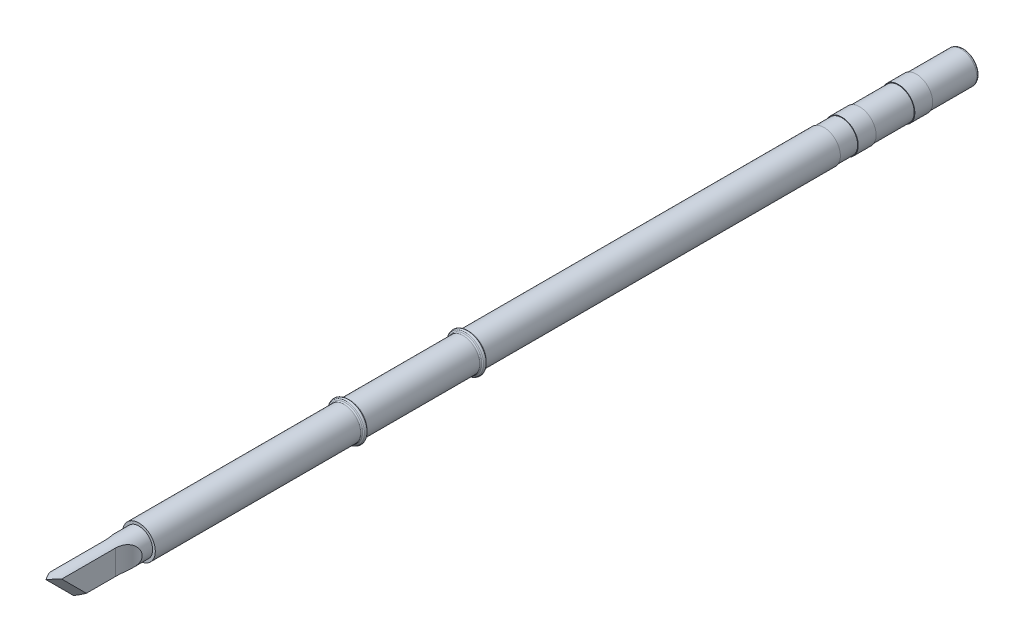
ISO-10303-21;
HEADER;
FILE_DESCRIPTION(('STEP AP214'),'2;1');
FILE_NAME('part.step','',(''),(''),'','','');
FILE_SCHEMA(('AUTOMOTIVE_DESIGN { 1 0 10303 214 1 1 1 1 }'));
ENDSEC;
DATA;
#1=APPLICATION_CONTEXT('core data for automotive mechanical design processes');
#2=APPLICATION_PROTOCOL_DEFINITION('international standard','automotive_design',2000,#1);
#3=PRODUCT_CONTEXT('',#1,'mechanical');
#4=PRODUCT('Part','Part','',(#3));
#5=PRODUCT_RELATED_PRODUCT_CATEGORY('part','',(#4));
#6=PRODUCT_DEFINITION_FORMATION('','',#4);
#7=PRODUCT_DEFINITION_CONTEXT('part definition',#1,'design');
#8=PRODUCT_DEFINITION('design','',#6,#7);
#9=PRODUCT_DEFINITION_SHAPE('','',#8);
#10=(LENGTH_UNIT() NAMED_UNIT(*) SI_UNIT(.MILLI.,.METRE.));
#11=(NAMED_UNIT(*) PLANE_ANGLE_UNIT() SI_UNIT($,.RADIAN.));
#12=(NAMED_UNIT(*) SI_UNIT($,.STERADIAN.) SOLID_ANGLE_UNIT());
#13=UNCERTAINTY_MEASURE_WITH_UNIT(LENGTH_MEASURE(1.E-05),#10,'distance_accuracy_value','');
#14=(GEOMETRIC_REPRESENTATION_CONTEXT(3) GLOBAL_UNCERTAINTY_ASSIGNED_CONTEXT((#13)) GLOBAL_UNIT_ASSIGNED_CONTEXT((#10,
#11,#12)) REPRESENTATION_CONTEXT('',''));
#15=CARTESIAN_POINT('',(0.,0.,0.));
#16=DIRECTION('',(0.,0.,1.));
#17=DIRECTION('',(1.,0.,0.));
#18=AXIS2_PLACEMENT_3D('',#15,#16,#17);
#19=CARTESIAN_POINT('',(5.49999999999999,-3.451,59.9138584039113));
#20=DIRECTION('',(0.,1.,0.));
#21=DIRECTION('',(0.,0.,1.));
#22=AXIS2_PLACEMENT_3D('',#19,#20,#21);
#23=CYLINDRICAL_SURFACE('',#22,4.5);
#24=DIRECTION('',(0.,1.,0.));
#25=VECTOR('',#24,1.);
#26=CARTESIAN_POINT('',(0.999999999999989,-3.451,59.9138584039113));
#27=LINE('',#26,#25);
#28=CARTESIAN_POINT('',(0.99999999999999,2.07123151772079,59.9138584039113));
#29=VERTEX_POINT('',#28);
#30=CARTESIAN_POINT('',(0.99999999999999,-2.0712315177208,59.9138584039113));
#31=VERTEX_POINT('',#30);
#32=EDGE_CURVE('E65',#29,#31,#27,.F.);
#33=ORIENTED_EDGE('',*,*,#32,.T.);
#34=CARTESIAN_POINT('',(0.999999999999989,2.07123151772079,59.9138584039113));
#35=CARTESIAN_POINT('',(0.999990164136857,2.07119815815279,59.8170228178122));
#36=CARTESIAN_POINT('',(1.00312535077805,2.06972108496105,59.7201815216386));
#37=CARTESIAN_POINT('',(1.01562060158117,2.06363890698835,59.5269530689614));
#38=CARTESIAN_POINT('',(1.02498373200551,2.05903226137156,59.4305661597234));
#39=CARTESIAN_POINT('',(1.04995833469827,2.04640502001243,59.2381245730669));
#40=CARTESIAN_POINT('',(1.06561389988844,2.03836030700736,59.1420771695639));
#41=CARTESIAN_POINT('',(1.10301561209331,2.01836818262503,58.9515994697621));
#42=CARTESIAN_POINT('',(1.12476046895969,2.00642159785471,58.8571688354079));
#43=CARTESIAN_POINT('',(1.17137274625354,1.97952656149142,58.6808283919663));
#44=CARTESIAN_POINT('',(1.19563219248429,1.96505385110455,58.5986853450189));
#45=CARTESIAN_POINT('',(1.24850366810335,1.93189365881997,58.4366867798049));
#46=CARTESIAN_POINT('',(1.27711496854463,1.91320688253686,58.356830881092));
#47=CARTESIAN_POINT('',(1.33822470909893,1.87097048911562,58.2001870165669));
#48=CARTESIAN_POINT('',(1.37071241731725,1.84743417231245,58.1233913311965));
#49=CARTESIAN_POINT('',(1.43905800808982,1.79470670351926,57.9733551591624));
#50=CARTESIAN_POINT('',(1.47491473392583,1.76551748876858,57.900113465274));
#51=CARTESIAN_POINT('',(1.56671586484657,1.68542839072626,57.7245408230183));
#52=CARTESIAN_POINT('',(1.62419810682449,1.63076510503854,57.6246662259081));
#53=CARTESIAN_POINT('',(1.74125768990528,1.50510915475616,57.4371577113669));
#54=CARTESIAN_POINT('',(1.80083227160955,1.43413736006184,57.3495083777546));
#55=CARTESIAN_POINT('',(1.90686333097346,1.28859942037882,57.2034969954033));
#56=CARTESIAN_POINT('',(1.95379009839001,1.21683913051974,57.1426940967195));
#57=CARTESIAN_POINT('',(2.04225064660516,1.06168196492217,57.0330712989519));
#58=CARTESIAN_POINT('',(2.0837856771183,0.978287795053207,56.9842486207091));
#59=CARTESIAN_POINT('',(2.15820880515384,0.800892633093474,56.8996174329548));
#60=CARTESIAN_POINT('',(2.19104726617959,0.706834952386293,56.8638832016117));
#61=CARTESIAN_POINT('',(2.24474876004013,0.511242887852875,56.8066243215562));
#62=CARTESIAN_POINT('',(2.26561568537962,0.409710946386483,56.7850950538055));
#63=CARTESIAN_POINT('',(2.29200928783163,0.213316638723987,56.7580526137231));
#64=CARTESIAN_POINT('',(2.29887883383524,0.118824335689177,56.7511347581348));
#65=CARTESIAN_POINT('',(2.30086622410926,-0.0703949215959663,56.749123105768));
#66=CARTESIAN_POINT('',(2.29598784069662,-0.165121790768364,56.7540255134465));
#67=CARTESIAN_POINT('',(2.27525709818278,-0.348426023838375,56.7751907249792));
#68=CARTESIAN_POINT('',(2.25982001001735,-0.437101039612753,56.7910238399434));
#69=CARTESIAN_POINT('',(2.21951444201115,-0.609590350939499,56.8333937772573));
#70=CARTESIAN_POINT('',(2.19464668501961,-0.693405018464099,56.8599297792538));
#71=CARTESIAN_POINT('',(2.13654662538712,-0.856036332248818,56.9240284495163));
#72=CARTESIAN_POINT('',(2.10313551274588,-0.934694200048059,56.9618301238735));
#73=CARTESIAN_POINT('',(2.03055602109635,-1.0833727747979,57.0474841477784));
#74=CARTESIAN_POINT('',(1.99138612717915,-1.1533912001094,57.0953391433849));
#75=CARTESIAN_POINT('',(1.9060945655324,-1.2899042412518,57.2047875365097));
#76=CARTESIAN_POINT('',(1.8596644734434,-1.35552295122236,57.2672270809095));
#77=CARTESIAN_POINT('',(1.76584395384337,-1.47567620580641,57.4013353344729));
#78=CARTESIAN_POINT('',(1.7184530581401,-1.53020519642173,57.4730086389181));
#79=CARTESIAN_POINT('',(1.63651525725854,-1.61692981124615,57.6056090093697));
#80=CARTESIAN_POINT('',(1.60164297719252,-1.65133365103257,57.664921490152));
#81=CARTESIAN_POINT('',(1.53356070986694,-1.71474683568975,57.7872977512708));
#82=CARTESIAN_POINT('',(1.50035141309401,-1.74375395314235,57.8503630664237));
#83=CARTESIAN_POINT('',(1.43618994964691,-1.79696982010163,57.9797751189187));
#84=CARTESIAN_POINT('',(1.40524307871913,-1.82116752592411,58.0461289812852));
#85=CARTESIAN_POINT('',(1.34616918869666,-1.86525764419837,58.1814766588126));
#86=CARTESIAN_POINT('',(1.31804290499893,-1.88514893541966,58.2504711560075));
#87=CARTESIAN_POINT('',(1.25607104307987,-1.92720681170302,58.4141660297481));
#88=CARTESIAN_POINT('',(1.2234744802262,-1.94789615863881,58.5097216581412));
#89=CARTESIAN_POINT('',(1.1645612730912,-1.98367925583796,58.7037893767942));
#90=CARTESIAN_POINT('',(1.13824731151717,-1.99877061724629,58.8023027098708));
#91=CARTESIAN_POINT('',(1.09229812042475,-2.02424654364779,59.0013917211873));
#92=CARTESIAN_POINT('',(1.07265845886127,-2.03463423362694,59.1019659836349));
#93=CARTESIAN_POINT('',(1.04026984279511,-2.05138265234376,59.3044990410174));
#94=CARTESIAN_POINT('',(1.02751754364634,-2.05774533596563,59.4064571392275));
#95=CARTESIAN_POINT('',(1.0121781774836,-2.06531845048815,59.5761694673036));
#96=CARTESIAN_POINT('',(1.00760663879488,-2.06754648195728,59.6437077168455));
#97=CARTESIAN_POINT('',(1.0015207120674,-2.07049741942328,59.7787819654972));
#98=CARTESIAN_POINT('',(0.999998551399799,-2.07122415226235,59.8463175304308));
#99=CARTESIAN_POINT('',(0.99999999999999,-2.0712315177208,59.9138584039113));
#100=B_SPLINE_CURVE_WITH_KNOTS('',3,(#34,#35,#36,#37,#38,#39,#40,#41,#42,#43,#44,#45,#46,#47,
#48,#49,#50,#51,#52,#53,#54,#55,#56,#57,#58,#59,#60,#61,#62,#63,#64,#65,#66,#67,#68,#69,#70,#71,
#72,#73,#74,#75,#76,#77,#78,#79,#80,#81,#82,#83,#84,#85,#86,#87,#88,#89,#90,#91,#92,#93,#94,#95,
#96,#97,#98,#99),.UNSPECIFIED.,.F.,.F.,(4,2,2,2,2,2,2,2,2,2,2,2,2,2,2,2,2,2,2,2,2,2,2,2,2,2,2,2,
2,2,2,2,4),(0.,0.290454207361779,0.581051522741789,0.87372166366611,1.16632984293759,
1.42670009554964,1.68702678339013,1.94664878309696,2.20618196768776,2.58736342091662,
2.96805976862572,3.28208964965084,3.59604661333611,3.91175867399452,4.22736802367167,
4.51091999972375,4.79438093800636,5.06728992505265,5.340177998185,5.61932664583926,
5.898548858356,6.20275554285508,6.5071142082141,6.73759358538915,6.96816787953869,
7.19926566704863,7.43042355167532,7.73916893935158,8.04804592825989,8.35671740587874,
8.66523885113466,8.86834784464165,9.0709384669443),.UNSPECIFIED.);
#101=EDGE_CURVE('E20',#29,#31,#100,.T.);
#102=ORIENTED_EDGE('',*,*,#101,.F.);
#103=EDGE_LOOP('',(#33,#102));
#104=FACE_BOUND('',#103,.T.);
#105=ADVANCED_FACE('F16',(#104),#23,.F.);
#106=CARTESIAN_POINT('',(0.999999999999989,-3.451,59.9138584039113));
#107=DIRECTION('',(-1.,0.,0.));
#108=DIRECTION('',(0.,0.,1.));
#109=AXIS2_PLACEMENT_3D('',#106,#107,#108);
#110=PLANE('',#109);
#111=DIRECTION('',(0.,0.,1.));
#112=VECTOR('',#111,1.);
#113=CARTESIAN_POINT('',(0.999999999999991,-2.0712315177208,55.));
#114=LINE('',#113,#112);
#115=CARTESIAN_POINT('',(0.999999999999995,-2.0712315177208,64.8145549199061));
#116=VERTEX_POINT('',#115);
#117=EDGE_CURVE('E295',#31,#116,#114,.T.);
#118=ORIENTED_EDGE('',*,*,#117,.F.);
#119=ORIENTED_EDGE('',*,*,#32,.F.);
#120=DIRECTION('',(0.,0.,1.));
#121=VECTOR('',#120,1.);
#122=CARTESIAN_POINT('',(0.999999999999992,2.07123151772079,55.));
#123=LINE('',#122,#121);
#124=CARTESIAN_POINT('',(0.999999999999995,2.07123151772079,68.9570179553477));
#125=VERTEX_POINT('',#124);
#126=EDGE_CURVE('E68',#125,#29,#123,.F.);
#127=ORIENTED_EDGE('',*,*,#126,.F.);
#128=DIRECTION('',(0.,-0.707106781186547,-0.707106781186548));
#129=VECTOR('',#128,1.);
#130=CARTESIAN_POINT('',(1.,2.07123151772078,68.9570179553477));
#131=LINE('',#130,#129);
#132=EDGE_CURVE('E71',#125,#116,#131,.T.);
#133=ORIENTED_EDGE('',*,*,#132,.T.);
#134=EDGE_LOOP('',(#118,#119,#127,#133));
#135=FACE_BOUND('',#134,.T.);
#136=ADVANCED_FACE('F70',(#135),#110,.F.);
#137=CARTESIAN_POINT('',(-5.50000000000001,-3.451,59.9138584039113));
#138=DIRECTION('',(0.,1.,0.));
#139=DIRECTION('',(0.,0.,1.));
#140=AXIS2_PLACEMENT_3D('',#137,#138,#139);
#141=CYLINDRICAL_SURFACE('',#140,4.5);
#142=DIRECTION('',(0.,1.,0.));
#143=VECTOR('',#142,1.);
#144=CARTESIAN_POINT('',(-1.00000000000001,-3.45100000000001,59.9138584039113));
#145=LINE('',#144,#143);
#146=CARTESIAN_POINT('',(-1.00000000000001,-2.0712315177208,59.9138584039113));
#147=VERTEX_POINT('',#146);
#148=CARTESIAN_POINT('',(-1.00000000000001,2.07123151772079,59.9138584039113));
#149=VERTEX_POINT('',#148);
#150=EDGE_CURVE('E300',#147,#149,#145,.T.);
#151=ORIENTED_EDGE('',*,*,#150,.T.);
#152=CARTESIAN_POINT('',(-1.00000000000001,-2.0712315177208,59.9138584039113));
#153=CARTESIAN_POINT('',(-0.999990164136877,-2.0711981581528,59.8170228178122));
#154=CARTESIAN_POINT('',(-1.00312535077807,-2.06972108496106,59.7201815216386));
#155=CARTESIAN_POINT('',(-1.01562060158119,-2.06363890698836,59.5269530689614));
#156=CARTESIAN_POINT('',(-1.02498373200553,-2.05903226137157,59.4305661597234));
#157=CARTESIAN_POINT('',(-1.04995833469829,-2.04640502001243,59.2381245730669));
#158=CARTESIAN_POINT('',(-1.06561389988846,-2.03836030700737,59.1420771695639));
#159=CARTESIAN_POINT('',(-1.10301561209333,-2.01836818262504,58.9515994697621));
#160=CARTESIAN_POINT('',(-1.12476046895971,-2.00642159785471,58.8571688354079));
#161=CARTESIAN_POINT('',(-1.17137274625356,-1.97952656149143,58.6808283919663));
#162=CARTESIAN_POINT('',(-1.19563219248431,-1.96505385110456,58.5986853450189));
#163=CARTESIAN_POINT('',(-1.24850366810337,-1.93189365881998,58.4366867798049));
#164=CARTESIAN_POINT('',(-1.27711496854465,-1.91320688253687,58.356830881092));
#165=CARTESIAN_POINT('',(-1.33822470909895,-1.87097048911563,58.2001870165669));
#166=CARTESIAN_POINT('',(-1.37071241731727,-1.84743417231245,58.1233913311965));
#167=CARTESIAN_POINT('',(-1.43905800808984,-1.79470670351927,57.9733551591624));
#168=CARTESIAN_POINT('',(-1.47491473392584,-1.76551748876858,57.900113465274));
#169=CARTESIAN_POINT('',(-1.56671586484659,-1.68542839072627,57.7245408230183));
#170=CARTESIAN_POINT('',(-1.62419810682451,-1.63076510503854,57.6246662259081));
#171=CARTESIAN_POINT('',(-1.74125768990529,-1.50510915475617,57.4371577113669));
#172=CARTESIAN_POINT('',(-1.80083227160957,-1.43413736006184,57.3495083777546));
#173=CARTESIAN_POINT('',(-1.90686333097348,-1.28859942037883,57.2034969954033));
#174=CARTESIAN_POINT('',(-1.95379009839003,-1.21683913051975,57.1426940967195));
#175=CARTESIAN_POINT('',(-2.04225064660518,-1.06168196492218,57.0330712989519));
#176=CARTESIAN_POINT('',(-2.08378567711832,-0.978287795053211,56.9842486207091));
#177=CARTESIAN_POINT('',(-2.15820880515386,-0.800892633093478,56.8996174329548));
#178=CARTESIAN_POINT('',(-2.19104726617961,-0.706834952386299,56.8638832016117));
#179=CARTESIAN_POINT('',(-2.24474876004015,-0.511242887852883,56.8066243215562));
#180=CARTESIAN_POINT('',(-2.26561568537964,-0.409710946386491,56.7850950538055));
#181=CARTESIAN_POINT('',(-2.29200928783165,-0.213316638723994,56.7580526137231));
#182=CARTESIAN_POINT('',(-2.29887883383526,-0.118824335689184,56.7511347581348));
#183=CARTESIAN_POINT('',(-2.30086622410928,0.0703949215959606,56.749123105768));
#184=CARTESIAN_POINT('',(-2.29598784069663,0.165121790768359,56.7540255134465));
#185=CARTESIAN_POINT('',(-2.27525709818279,0.34842602383837,56.7751907249792));
#186=CARTESIAN_POINT('',(-2.25982001001737,0.437101039612747,56.7910238399434));
#187=CARTESIAN_POINT('',(-2.21951444201117,0.609590350939493,56.8333937772573));
#188=CARTESIAN_POINT('',(-2.19464668501963,0.693405018464093,56.8599297792538));
#189=CARTESIAN_POINT('',(-2.13654662538713,0.856036332248814,56.9240284495163));
#190=CARTESIAN_POINT('',(-2.10313551274589,0.934694200048056,56.9618301238735));
#191=CARTESIAN_POINT('',(-2.03055602109637,1.0833727747979,57.0474841477784));
#192=CARTESIAN_POINT('',(-1.99138612717917,1.15339120010939,57.0953391433849));
#193=CARTESIAN_POINT('',(-1.90609456553241,1.28990424125179,57.2047875365097));
#194=CARTESIAN_POINT('',(-1.85966447344342,1.35552295122236,57.2672270809095));
#195=CARTESIAN_POINT('',(-1.76584395384338,1.4756762058064,57.4013353344729));
#196=CARTESIAN_POINT('',(-1.71845305814012,1.53020519642173,57.4730086389181));
#197=CARTESIAN_POINT('',(-1.63651525725856,1.61692981124614,57.6056090093697));
#198=CARTESIAN_POINT('',(-1.60164297719254,1.65133365103257,57.664921490152));
#199=CARTESIAN_POINT('',(-1.53356070986695,1.71474683568975,57.7872977512709));
#200=CARTESIAN_POINT('',(-1.50035141309403,1.74375395314234,57.8503630664237));
#201=CARTESIAN_POINT('',(-1.43618994964693,1.79696982010163,57.9797751189187));
#202=CARTESIAN_POINT('',(-1.40524307871915,1.8211675259241,58.0461289812852));
#203=CARTESIAN_POINT('',(-1.34616918869667,1.86525764419836,58.1814766588126));
#204=CARTESIAN_POINT('',(-1.31804290499894,1.88514893541965,58.2504711560075));
#205=CARTESIAN_POINT('',(-1.25607104307989,1.92720681170301,58.4141660297481));
#206=CARTESIAN_POINT('',(-1.22347448022622,1.94789615863881,58.5097216581412));
#207=CARTESIAN_POINT('',(-1.16456127309121,1.98367925583796,58.7037893767943));
#208=CARTESIAN_POINT('',(-1.13824731151718,1.99877061724628,58.8023027098709));
#209=CARTESIAN_POINT('',(-1.09229812042477,2.02424654364779,59.0013917211873));
#210=CARTESIAN_POINT('',(-1.07265845886128,2.03463423362693,59.101965983635));
#211=CARTESIAN_POINT('',(-1.04026984279512,2.05138265234375,59.3044990410174));
#212=CARTESIAN_POINT('',(-1.02751754364636,2.05774533596562,59.4064571392276));
#213=CARTESIAN_POINT('',(-1.01217817748362,2.06531845048814,59.5761694673036));
#214=CARTESIAN_POINT('',(-1.0076066387949,2.06754648195727,59.6437077168456));
#215=CARTESIAN_POINT('',(-1.00152071206742,2.07049741942327,59.7787819654972));
#216=CARTESIAN_POINT('',(-0.999998551399819,2.07122415226234,59.8463175304308));
#217=CARTESIAN_POINT('',(-1.00000000000001,2.07123151772079,59.9138584039113));
#218=B_SPLINE_CURVE_WITH_KNOTS('',3,(#152,#153,#154,#155,#156,#157,#158,#159,#160,#161,#162,
#163,#164,#165,#166,#167,#168,#169,#170,#171,#172,#173,#174,#175,#176,#177,#178,#179,#180,#181,
#182,#183,#184,#185,#186,#187,#188,#189,#190,#191,#192,#193,#194,#195,#196,#197,#198,#199,#200,
#201,#202,#203,#204,#205,#206,#207,#208,#209,#210,#211,#212,#213,#214,#215,#216,#217),
.UNSPECIFIED.,.F.,.F.,(4,2,2,2,2,2,2,2,2,2,2,2,2,2,2,2,2,2,2,2,2,2,2,2,2,2,2,2,2,2,2,2,4),(0.,
0.290454207361786,0.581051522741789,0.87372166366611,1.16632984293759,1.42670009554964,
1.68702678339013,1.94664878309695,2.20618196768775,2.58736342091661,2.96805976862572,
3.28208964965084,3.59604661333611,3.91175867399452,4.22736802367166,4.51091999972375,
4.79438093800636,5.06728992505265,5.340177998185,5.61932664583927,5.898548858356,
6.2027555428551,6.5071142082141,6.73759358538916,6.96816787953869,7.19926566704864,
7.43042355167532,7.73916893935159,8.04804592825991,8.35671740587877,8.66523885113468,
8.86834784464166,9.0709384669443),.UNSPECIFIED.);
#219=EDGE_CURVE('E97',#147,#149,#218,.T.);
#220=ORIENTED_EDGE('',*,*,#219,.F.);
#221=EDGE_LOOP('',(#151,#220));
#222=FACE_BOUND('',#221,.T.);
#223=ADVANCED_FACE('F106',(#222),#141,.F.);
#224=CARTESIAN_POINT('',(-1.00000000000001,-3.45100000000001,73.3018844201431));
#225=DIRECTION('',(1.,0.,0.));
#226=DIRECTION('',(0.,0.,-1.));
#227=AXIS2_PLACEMENT_3D('',#224,#225,#226);
#228=PLANE('',#227);
#229=DIRECTION('',(0.,0.,1.));
#230=VECTOR('',#229,1.);
#231=CARTESIAN_POINT('',(-1.00000000000001,2.07123151772079,55.));
#232=LINE('',#231,#230);
#233=CARTESIAN_POINT('',(-1.00000000000002,2.07123151772079,68.9570179553477));
#234=VERTEX_POINT('',#233);
#235=EDGE_CURVE('E93',#149,#234,#232,.T.);
#236=ORIENTED_EDGE('',*,*,#235,.F.);
#237=ORIENTED_EDGE('',*,*,#150,.F.);
#238=DIRECTION('',(0.,0.,1.));
#239=VECTOR('',#238,1.);
#240=CARTESIAN_POINT('',(-1.00000000000001,-2.0712315177208,55.));
#241=LINE('',#240,#239);
#242=CARTESIAN_POINT('',(-1.00000000000001,-2.0712315177208,64.8145549199061));
#243=VERTEX_POINT('',#242);
#244=EDGE_CURVE('E104',#243,#147,#241,.F.);
#245=ORIENTED_EDGE('',*,*,#244,.F.);
#246=DIRECTION('',(0.,0.707106781186549,0.707106781186546));
#247=VECTOR('',#246,1.);
#248=CARTESIAN_POINT('',(-1.00000000000002,-2.07123151772081,64.8145549199061));
#249=LINE('',#248,#247);
#250=EDGE_CURVE('E298',#243,#234,#249,.T.);
#251=ORIENTED_EDGE('',*,*,#250,.T.);
#252=EDGE_LOOP('',(#236,#237,#245,#251));
#253=FACE_BOUND('',#252,.T.);
#254=ADVANCED_FACE('F121',(#253),#228,.F.);
#255=CARTESIAN_POINT('',(-1.00000000000001,-4.19255186128045,62.6932345763465));
#256=DIRECTION('',(0.707106781186547,0.499999999999999,-0.500000000000001));
#257=DIRECTION('',(-0.577350269189627,0.,-0.816496580927725));
#258=AXIS2_PLACEMENT_3D('',#255,#256,#257);
#259=PLANE('',#258);
#260=CARTESIAN_POINT('',(0.,0.,68.3));
#261=DIRECTION('',(0.707106781186547,0.499999999999999,-0.500000000000001));
#262=DIRECTION('',(0.408248290463864,0.288675134594813,0.866025403784438));
#263=AXIS2_PLACEMENT_3D('',#260,#261,#262);
#264=ELLIPSE('',#263,4.59999999999999,2.3);
#265=CARTESIAN_POINT('',(0.,-2.3,66.));
#266=VERTEX_POINT('',#265);
#267=EDGE_CURVE('E105',#266,#243,#264,.T.);
#268=ORIENTED_EDGE('',*,*,#267,.F.);
#269=DIRECTION('',(0.,0.707106781186547,0.707106781186548));
#270=VECTOR('',#269,1.);
#271=CARTESIAN_POINT('',(0.,-2.30000000000001,66.));
#272=LINE('',#271,#270);
#273=CARTESIAN_POINT('',(0.,2.3,70.6));
#274=VERTEX_POINT('',#273);
#275=EDGE_CURVE('E39',#266,#274,#272,.T.);
#276=ORIENTED_EDGE('',*,*,#275,.T.);
#277=CARTESIAN_POINT('',(0.,0.,68.3));
#278=DIRECTION('',(0.707106781186547,0.499999999999999,-0.500000000000001));
#279=DIRECTION('',(0.408248290463864,0.288675134594813,0.866025403784438));
#280=AXIS2_PLACEMENT_3D('',#277,#278,#279);
#281=ELLIPSE('',#280,4.59999999999999,2.3);
#282=EDGE_CURVE('E87',#234,#274,#281,.T.);
#283=ORIENTED_EDGE('',*,*,#282,.F.);
#284=ORIENTED_EDGE('',*,*,#250,.F.);
#285=EDGE_LOOP('',(#268,#276,#283,#284));
#286=FACE_BOUND('',#285,.T.);
#287=ADVANCED_FACE('F119',(#286),#259,.F.);
#288=CARTESIAN_POINT('',(0.999999999999988,5.60676542365356,72.4925518612805));
#289=DIRECTION('',(-0.707106781186545,0.500000000000002,-0.500000000000002));
#290=DIRECTION('',(-0.577350269189629,-0.816496580927724,0.));
#291=AXIS2_PLACEMENT_3D('',#288,#289,#290);
#292=PLANE('',#291);
#293=CARTESIAN_POINT('',(0.,0.,68.3));
#294=DIRECTION('',(-0.707106781186545,0.500000000000002,-0.500000000000002));
#295=DIRECTION('',(-0.408248290463864,0.288675134594815,0.866025403784438));
#296=AXIS2_PLACEMENT_3D('',#293,#294,#295);
#297=ELLIPSE('',#296,4.59999999999998,2.3);
#298=EDGE_CURVE('E79',#274,#125,#297,.T.);
#299=ORIENTED_EDGE('',*,*,#298,.F.);
#300=ORIENTED_EDGE('',*,*,#275,.F.);
#301=CARTESIAN_POINT('',(0.,0.,68.3));
#302=DIRECTION('',(-0.707106781186545,0.500000000000002,-0.500000000000002));
#303=DIRECTION('',(-0.408248290463864,0.288675134594815,0.866025403784438));
#304=AXIS2_PLACEMENT_3D('',#301,#302,#303);
#305=ELLIPSE('',#304,4.59999999999998,2.3);
#306=EDGE_CURVE('E82',#116,#266,#305,.T.);
#307=ORIENTED_EDGE('',*,*,#306,.F.);
#308=ORIENTED_EDGE('',*,*,#132,.F.);
#309=EDGE_LOOP('',(#299,#300,#307,#308));
#310=FACE_BOUND('',#309,.T.);
#311=ADVANCED_FACE('F78',(#310),#292,.F.);
#312=CARTESIAN_POINT('',(0.,0.,55.));
#313=DIRECTION('',(0.,0.,1.));
#314=DIRECTION('',(1.,0.,0.));
#315=AXIS2_PLACEMENT_3D('',#312,#313,#314);
#316=CYLINDRICAL_SURFACE('',#315,2.3);
#317=CARTESIAN_POINT('',(0.,0.,55.));
#318=DIRECTION('',(0.,0.,1.));
#319=DIRECTION('',(1.,0.,0.));
#320=AXIS2_PLACEMENT_3D('',#317,#318,#319);
#321=CIRCLE('',#320,2.3);
#322=CARTESIAN_POINT('',(2.29999999999999,0.,55.));
#323=VERTEX_POINT('',#322);
#324=EDGE_CURVE('E88',#323,#323,#321,.F.);
#325=ORIENTED_EDGE('',*,*,#324,.F.);
#326=EDGE_LOOP('',(#325));
#327=FACE_BOUND('',#326,.T.);
#328=ORIENTED_EDGE('',*,*,#282,.T.);
#329=ORIENTED_EDGE('',*,*,#298,.T.);
#330=ORIENTED_EDGE('',*,*,#126,.T.);
#331=ORIENTED_EDGE('',*,*,#101,.T.);
#332=ORIENTED_EDGE('',*,*,#117,.T.);
#333=ORIENTED_EDGE('',*,*,#306,.T.);
#334=ORIENTED_EDGE('',*,*,#267,.T.);
#335=ORIENTED_EDGE('',*,*,#244,.T.);
#336=ORIENTED_EDGE('',*,*,#219,.T.);
#337=ORIENTED_EDGE('',*,*,#235,.T.);
#338=EDGE_LOOP('',(#328,#329,#330,#331,#332,#333,#334,#335,#336,#337));
#339=FACE_BOUND('',#338,.T.);
#340=ADVANCED_FACE('F85',(#327,#339),#316,.T.);
#341=CARTESIAN_POINT('',(0.,0.,55.));
#342=DIRECTION('',(0.,0.,1.));
#343=DIRECTION('',(1.,0.,0.));
#344=AXIS2_PLACEMENT_3D('',#341,#342,#343);
#345=PLANE('',#344);
#346=ORIENTED_EDGE('',*,*,#324,.T.);
#347=EDGE_LOOP('',(#346));
#348=FACE_BOUND('',#347,.T.);
#349=CARTESIAN_POINT('',(0.,0.,55.));
#350=DIRECTION('',(0.,0.,-1.));
#351=DIRECTION('',(-1.,0.,0.));
#352=AXIS2_PLACEMENT_3D('',#349,#350,#351);
#353=CIRCLE('',#352,2.75);
#354=CARTESIAN_POINT('',(-2.75000000000001,0.,55.));
#355=VERTEX_POINT('',#354);
#356=EDGE_CURVE('E91',#355,#355,#353,.T.);
#357=ORIENTED_EDGE('',*,*,#356,.F.);
#358=EDGE_LOOP('',(#357));
#359=FACE_BOUND('',#358,.T.);
#360=ADVANCED_FACE('F113',(#348,#359),#345,.T.);
#361=CARTESIAN_POINT('',(0.,0.,55.));
#362=DIRECTION('',(0.,0.,-1.));
#363=DIRECTION('',(-1.,0.,0.));
#364=AXIS2_PLACEMENT_3D('',#361,#362,#363);
#365=CYLINDRICAL_SURFACE('',#364,2.75);
#366=CARTESIAN_POINT('',(0.,0.,20.5451833703516));
#367=DIRECTION('',(0.,0.,-1.));
#368=DIRECTION('',(-1.,0.,0.));
#369=AXIS2_PLACEMENT_3D('',#366,#367,#368);
#370=CIRCLE('',#369,2.75);
#371=CARTESIAN_POINT('',(-2.75,0.,20.5451833703516));
#372=VERTEX_POINT('',#371);
#373=EDGE_CURVE('E325',#372,#372,#370,.F.);
#374=ORIENTED_EDGE('',*,*,#373,.T.);
#375=EDGE_LOOP('',(#374));
#376=FACE_BOUND('',#375,.T.);
#377=ORIENTED_EDGE('',*,*,#356,.T.);
#378=EDGE_LOOP('',(#377));
#379=FACE_BOUND('',#378,.T.);
#380=ADVANCED_FACE('F346',(#376,#379),#365,.T.);
#381=CARTESIAN_POINT('',(0.,0.,-83.5));
#382=DIRECTION('',(0.,0.,-1.));
#383=DIRECTION('',(-1.,0.,0.));
#384=AXIS2_PLACEMENT_3D('',#381,#382,#383);
#385=PLANE('',#384);
#386=CARTESIAN_POINT('',(0.,0.,-83.5));
#387=DIRECTION('',(0.,0.,1.));
#388=DIRECTION('',(-1.,0.,0.));
#389=AXIS2_PLACEMENT_3D('',#386,#387,#388);
#390=CIRCLE('',#389,2.15);
#391=CARTESIAN_POINT('',(-2.14999999999998,0.,-83.5));
#392=VERTEX_POINT('',#391);
#393=EDGE_CURVE('E264',#392,#392,#390,.T.);
#394=ORIENTED_EDGE('',*,*,#393,.F.);
#395=EDGE_LOOP('',(#394));
#396=FACE_BOUND('',#395,.T.);
#397=ADVANCED_FACE('F338',(#396),#385,.T.);
#398=CARTESIAN_POINT('',(0.,0.,20.5451833703516));
#399=DIRECTION('',(0.,0.,-1.));
#400=DIRECTION('',(-1.,0.,0.));
#401=AXIS2_PLACEMENT_3D('',#398,#399,#400);
#402=TOROIDAL_SURFACE('',#401,3.,0.25);
#403=CARTESIAN_POINT('',(0.,0.,20.3280463788929));
#404=DIRECTION('',(0.,0.,-1.));
#405=DIRECTION('',(-1.,0.,0.));
#406=AXIS2_PLACEMENT_3D('',#403,#404,#405);
#407=CIRCLE('',#406,2.87609872100347);
#408=CARTESIAN_POINT('',(-2.87609872100347,0.,20.3280463788929));
#409=VERTEX_POINT('',#408);
#410=EDGE_CURVE('E259',#409,#409,#407,.T.);
#411=ORIENTED_EDGE('',*,*,#410,.F.);
#412=EDGE_LOOP('',(#411));
#413=FACE_BOUND('',#412,.T.);
#414=ORIENTED_EDGE('',*,*,#373,.F.);
#415=EDGE_LOOP('',(#414));
#416=FACE_BOUND('',#415,.T.);
#417=ADVANCED_FACE('F277',(#413,#416),#402,.F.);
#418=CARTESIAN_POINT('',(0.,0.,-83.));
#419=DIRECTION('',(0.,0.,-1.));
#420=DIRECTION('',(-1.,0.,0.));
#421=AXIS2_PLACEMENT_3D('',#418,#419,#420);
#422=TOROIDAL_SURFACE('',#421,2.15,0.5);
#423=CARTESIAN_POINT('',(0.,0.,-83.));
#424=DIRECTION('',(0.,0.,-1.));
#425=DIRECTION('',(-1.,0.,0.));
#426=AXIS2_PLACEMENT_3D('',#423,#424,#425);
#427=CIRCLE('',#426,2.65);
#428=CARTESIAN_POINT('',(-2.64999999999998,0.,-83.));
#429=VERTEX_POINT('',#428);
#430=EDGE_CURVE('E254',#429,#429,#427,.F.);
#431=ORIENTED_EDGE('',*,*,#430,.F.);
#432=EDGE_LOOP('',(#431));
#433=FACE_BOUND('',#432,.T.);
#434=ORIENTED_EDGE('',*,*,#393,.T.);
#435=EDGE_LOOP('',(#434));
#436=FACE_BOUND('',#435,.T.);
#437=ADVANCED_FACE('F272',(#433,#436),#422,.T.);
#438=CARTESIAN_POINT('',(0.,0.,20.2171369915618));
#439=DIRECTION('',(0.,0.,-1.));
#440=DIRECTION('',(-1.,0.,0.));
#441=AXIS2_PLACEMENT_3D('',#438,#439,#440);
#442=CONICAL_SURFACE('',#441,3.07046742227612,1.0522649349584);
#443=CARTESIAN_POINT('',(0.,0.,20.2171369914602));
#444=DIRECTION('',(0.,0.,-1.));
#445=DIRECTION('',(-1.,0.,0.));
#446=AXIS2_PLACEMENT_3D('',#443,#444,#445);
#447=CIRCLE('',#446,3.07046742246604);
#448=CARTESIAN_POINT('',(-3.07046742246605,0.,20.2171369914602));
#449=VERTEX_POINT('',#448);
#450=EDGE_CURVE('E250',#449,#449,#447,.T.);
#451=ORIENTED_EDGE('',*,*,#450,.F.);
#452=EDGE_LOOP('',(#451));
#453=FACE_BOUND('',#452,.T.);
#454=ORIENTED_EDGE('',*,*,#410,.T.);
#455=EDGE_LOOP('',(#454));
#456=FACE_BOUND('',#455,.T.);
#457=ADVANCED_FACE('F276',(#453,#456),#442,.T.);
#458=CARTESIAN_POINT('',(0.,0.,-75.5));
#459=DIRECTION('',(0.,0.,-1.));
#460=DIRECTION('',(-1.,0.,0.));
#461=AXIS2_PLACEMENT_3D('',#458,#459,#460);
#462=CYLINDRICAL_SURFACE('',#461,2.65);
#463=ORIENTED_EDGE('',*,*,#430,.T.);
#464=EDGE_LOOP('',(#463));
#465=FACE_BOUND('',#464,.T.);
#466=CARTESIAN_POINT('',(0.,0.,-75.5));
#467=DIRECTION('',(0.,0.,-1.));
#468=DIRECTION('',(-1.,0.,0.));
#469=AXIS2_PLACEMENT_3D('',#466,#467,#468);
#470=CIRCLE('',#469,2.65);
#471=CARTESIAN_POINT('',(-2.64999999999999,0.,-75.5));
#472=VERTEX_POINT('',#471);
#473=EDGE_CURVE('E253',#472,#472,#470,.F.);
#474=ORIENTED_EDGE('',*,*,#473,.F.);
#475=EDGE_LOOP('',(#474));
#476=FACE_BOUND('',#475,.T.);
#477=ADVANCED_FACE('F242',(#465,#476),#462,.T.);
#478=CARTESIAN_POINT('',(0.,0.,20.));
#479=DIRECTION('',(0.,0.,-1.));
#480=DIRECTION('',(-1.,0.,0.));
#481=AXIS2_PLACEMENT_3D('',#478,#479,#480);
#482=TOROIDAL_SURFACE('',#481,2.94656614345883,0.25);
#483=CARTESIAN_POINT('',(0.,0.,19.7828630085723));
#484=DIRECTION('',(0.,0.,1.));
#485=DIRECTION('',(1.,0.,0.));
#486=AXIS2_PLACEMENT_3D('',#483,#484,#485);
#487=CIRCLE('',#486,3.0704674225035);
#488=CARTESIAN_POINT('',(3.0704674225035,0.,19.7828630085723));
#489=VERTEX_POINT('',#488);
#490=EDGE_CURVE('E322',#489,#489,#487,.F.);
#491=ORIENTED_EDGE('',*,*,#490,.F.);
#492=EDGE_LOOP('',(#491));
#493=FACE_BOUND('',#492,.T.);
#494=ORIENTED_EDGE('',*,*,#450,.T.);
#495=EDGE_LOOP('',(#494));
#496=FACE_BOUND('',#495,.T.);
#497=ADVANCED_FACE('F237',(#493,#496),#482,.T.);
#498=CARTESIAN_POINT('',(0.,0.,-75.5));
#499=DIRECTION('',(0.,0.,-1.));
#500=DIRECTION('',(-1.,0.,0.));
#501=AXIS2_PLACEMENT_3D('',#498,#499,#500);
#502=PLANE('',#501);
#503=ORIENTED_EDGE('',*,*,#473,.T.);
#504=EDGE_LOOP('',(#503));
#505=FACE_BOUND('',#504,.T.);
#506=CARTESIAN_POINT('',(0.,0.,-75.5));
#507=DIRECTION('',(0.,0.,-1.));
#508=DIRECTION('',(-1.,0.,0.));
#509=AXIS2_PLACEMENT_3D('',#506,#507,#508);
#510=CIRCLE('',#509,2.75);
#511=CARTESIAN_POINT('',(-2.74999999999999,0.,-75.5));
#512=VERTEX_POINT('',#511);
#513=EDGE_CURVE('E319',#512,#512,#510,.F.);
#514=ORIENTED_EDGE('',*,*,#513,.F.);
#515=EDGE_LOOP('',(#514));
#516=FACE_BOUND('',#515,.T.);
#517=ADVANCED_FACE('F233',(#505,#516),#502,.T.);
#518=CARTESIAN_POINT('',(0.,0.,19.7828630084587));
#519=DIRECTION('',(0.,0.,1.));
#520=DIRECTION('',(1.,0.,0.));
#521=AXIS2_PLACEMENT_3D('',#518,#519,#520);
#522=CONICAL_SURFACE('',#521,3.07046742227613,1.0522649349584);
#523=ORIENTED_EDGE('',*,*,#490,.T.);
#524=EDGE_LOOP('',(#523));
#525=FACE_BOUND('',#524,.T.);
#526=CARTESIAN_POINT('',(0.,0.,19.6719536211086));
#527=DIRECTION('',(0.,0.,-1.));
#528=DIRECTION('',(-1.,0.,0.));
#529=AXIS2_PLACEMENT_3D('',#526,#527,#528);
#530=CIRCLE('',#529,2.87609872099278);
#531=CARTESIAN_POINT('',(-2.87609872099279,0.,19.6719536211086));
#532=VERTEX_POINT('',#531);
#533=EDGE_CURVE('E217',#532,#532,#530,.F.);
#534=ORIENTED_EDGE('',*,*,#533,.T.);
#535=EDGE_LOOP('',(#534));
#536=FACE_BOUND('',#535,.T.);
#537=ADVANCED_FACE('F229',(#525,#536),#522,.T.);
#538=CARTESIAN_POINT('',(0.,0.,-72.5));
#539=DIRECTION('',(0.,0.,-1.));
#540=DIRECTION('',(-1.,0.,0.));
#541=AXIS2_PLACEMENT_3D('',#538,#539,#540);
#542=CYLINDRICAL_SURFACE('',#541,2.75);
#543=ORIENTED_EDGE('',*,*,#513,.T.);
#544=EDGE_LOOP('',(#543));
#545=FACE_BOUND('',#544,.T.);
#546=CARTESIAN_POINT('',(0.,0.,-72.5));
#547=DIRECTION('',(0.,0.,-1.));
#548=DIRECTION('',(-1.,0.,0.));
#549=AXIS2_PLACEMENT_3D('',#546,#547,#548);
#550=CIRCLE('',#549,2.75);
#551=CARTESIAN_POINT('',(-2.74999999999999,0.,-72.5));
#552=VERTEX_POINT('',#551);
#553=EDGE_CURVE('E212',#552,#552,#550,.F.);
#554=ORIENTED_EDGE('',*,*,#553,.F.);
#555=EDGE_LOOP('',(#554));
#556=FACE_BOUND('',#555,.T.);
#557=ADVANCED_FACE('F225',(#545,#556),#542,.T.);
#558=CARTESIAN_POINT('',(0.,0.,19.4548166296484));
#559=DIRECTION('',(0.,0.,-1.));
#560=DIRECTION('',(-1.,0.,0.));
#561=AXIS2_PLACEMENT_3D('',#558,#559,#560);
#562=TOROIDAL_SURFACE('',#561,3.,0.25);
#563=ORIENTED_EDGE('',*,*,#533,.F.);
#564=EDGE_LOOP('',(#563));
#565=FACE_BOUND('',#564,.T.);
#566=CARTESIAN_POINT('',(0.,0.,19.4548166296484));
#567=DIRECTION('',(0.,0.,-1.));
#568=DIRECTION('',(-1.,0.,0.));
#569=AXIS2_PLACEMENT_3D('',#566,#567,#568);
#570=CIRCLE('',#569,2.75);
#571=CARTESIAN_POINT('',(-2.75,0.,19.4548166296484));
#572=VERTEX_POINT('',#571);
#573=EDGE_CURVE('E209',#572,#572,#570,.T.);
#574=ORIENTED_EDGE('',*,*,#573,.F.);
#575=EDGE_LOOP('',(#574));
#576=FACE_BOUND('',#575,.T.);
#577=ADVANCED_FACE('F220',(#565,#576),#562,.F.);
#578=CARTESIAN_POINT('',(0.,0.,-72.5));
#579=DIRECTION('',(0.,0.,1.));
#580=DIRECTION('',(1.,0.,0.));
#581=AXIS2_PLACEMENT_3D('',#578,#579,#580);
#582=PLANE('',#581);
#583=CARTESIAN_POINT('',(0.,0.,-72.5));
#584=DIRECTION('',(0.,0.,-1.));
#585=DIRECTION('',(-1.,0.,0.));
#586=AXIS2_PLACEMENT_3D('',#583,#584,#585);
#587=CIRCLE('',#586,2.65);
#588=CARTESIAN_POINT('',(-2.64999999999999,0.,-72.5));
#589=VERTEX_POINT('',#588);
#590=EDGE_CURVE('E206',#589,#589,#587,.F.);
#591=ORIENTED_EDGE('',*,*,#590,.F.);
#592=EDGE_LOOP('',(#591));
#593=FACE_BOUND('',#592,.T.);
#594=ORIENTED_EDGE('',*,*,#553,.T.);
#595=EDGE_LOOP('',(#594));
#596=FACE_BOUND('',#595,.T.);
#597=ADVANCED_FACE('F224',(#593,#596),#582,.T.);
#598=CARTESIAN_POINT('',(0.,0.,19.6));
#599=DIRECTION('',(0.,0.,-1.));
#600=DIRECTION('',(-1.,0.,0.));
#601=AXIS2_PLACEMENT_3D('',#598,#599,#600);
#602=CYLINDRICAL_SURFACE('',#601,2.75);
#603=CARTESIAN_POINT('',(0.,0.,0.545183370351594));
#604=DIRECTION('',(0.,0.,-1.));
#605=DIRECTION('',(-1.,0.,0.));
#606=AXIS2_PLACEMENT_3D('',#603,#604,#605);
#607=CIRCLE('',#606,2.75);
#608=CARTESIAN_POINT('',(-2.75,0.,0.545183370351594));
#609=VERTEX_POINT('',#608);
#610=EDGE_CURVE('E202',#609,#609,#607,.F.);
#611=ORIENTED_EDGE('',*,*,#610,.T.);
#612=EDGE_LOOP('',(#611));
#613=FACE_BOUND('',#612,.T.);
#614=ORIENTED_EDGE('',*,*,#573,.T.);
#615=EDGE_LOOP('',(#614));
#616=FACE_BOUND('',#615,.T.);
#617=ADVANCED_FACE('F484',(#613,#616),#602,.T.);
#618=CARTESIAN_POINT('',(0.,0.,-66.));
#619=DIRECTION('',(0.,0.,-1.));
#620=DIRECTION('',(-1.,0.,0.));
#621=AXIS2_PLACEMENT_3D('',#618,#619,#620);
#622=CYLINDRICAL_SURFACE('',#621,2.65);
#623=ORIENTED_EDGE('',*,*,#590,.T.);
#624=EDGE_LOOP('',(#623));
#625=FACE_BOUND('',#624,.T.);
#626=CARTESIAN_POINT('',(0.,0.,-66.));
#627=DIRECTION('',(0.,0.,-1.));
#628=DIRECTION('',(-1.,0.,0.));
#629=AXIS2_PLACEMENT_3D('',#626,#627,#628);
#630=CIRCLE('',#629,2.65);
#631=CARTESIAN_POINT('',(-2.64999999999999,0.,-66.));
#632=VERTEX_POINT('',#631);
#633=EDGE_CURVE('E205',#632,#632,#630,.F.);
#634=ORIENTED_EDGE('',*,*,#633,.F.);
#635=EDGE_LOOP('',(#634));
#636=FACE_BOUND('',#635,.T.);
#637=ADVANCED_FACE('F194',(#625,#636),#622,.T.);
#638=CARTESIAN_POINT('',(0.,0.,0.545183370351595));
#639=DIRECTION('',(0.,0.,-1.));
#640=DIRECTION('',(-1.,0.,0.));
#641=AXIS2_PLACEMENT_3D('',#638,#639,#640);
#642=TOROIDAL_SURFACE('',#641,3.,0.25);
#643=CARTESIAN_POINT('',(0.,0.,0.32804637891104));
#644=DIRECTION('',(0.,0.,-1.));
#645=DIRECTION('',(-1.,0.,0.));
#646=AXIS2_PLACEMENT_3D('',#643,#644,#645);
#647=CIRCLE('',#646,2.87609872106032);
#648=CARTESIAN_POINT('',(-2.87609872106032,0.,0.32804637891104));
#649=VERTEX_POINT('',#648);
#650=EDGE_CURVE('E312',#649,#649,#647,.T.);
#651=ORIENTED_EDGE('',*,*,#650,.F.);
#652=EDGE_LOOP('',(#651));
#653=FACE_BOUND('',#652,.T.);
#654=ORIENTED_EDGE('',*,*,#610,.F.);
#655=EDGE_LOOP('',(#654));
#656=FACE_BOUND('',#655,.T.);
#657=ADVANCED_FACE('F189',(#653,#656),#642,.F.);
#658=CARTESIAN_POINT('',(0.,0.,-66.));
#659=DIRECTION('',(0.,0.,-1.));
#660=DIRECTION('',(-1.,0.,0.));
#661=AXIS2_PLACEMENT_3D('',#658,#659,#660);
#662=PLANE('',#661);
#663=ORIENTED_EDGE('',*,*,#633,.T.);
#664=EDGE_LOOP('',(#663));
#665=FACE_BOUND('',#664,.T.);
#666=CARTESIAN_POINT('',(0.,0.,-66.));
#667=DIRECTION('',(0.,0.,-1.));
#668=DIRECTION('',(-1.,0.,0.));
#669=AXIS2_PLACEMENT_3D('',#666,#667,#668);
#670=CIRCLE('',#669,2.75);
#671=CARTESIAN_POINT('',(-2.74999999999999,0.,-66.));
#672=VERTEX_POINT('',#671);
#673=EDGE_CURVE('E309',#672,#672,#670,.F.);
#674=ORIENTED_EDGE('',*,*,#673,.F.);
#675=EDGE_LOOP('',(#674));
#676=FACE_BOUND('',#675,.T.);
#677=ADVANCED_FACE('F185',(#665,#676),#662,.T.);
#678=CARTESIAN_POINT('',(0.,0.,0.217136991523149));
#679=DIRECTION('',(0.,0.,-1.));
#680=DIRECTION('',(-1.,0.,0.));
#681=AXIS2_PLACEMENT_3D('',#678,#679,#680);
#682=CONICAL_SURFACE('',#681,3.07046742244666,1.05226493508429);
#683=CARTESIAN_POINT('',(0.,0.,0.217136991460171));
#684=DIRECTION('',(0.,0.,-1.));
#685=DIRECTION('',(-1.,0.,0.));
#686=AXIS2_PLACEMENT_3D('',#683,#684,#685);
#687=CIRCLE('',#686,3.07046742246605);
#688=CARTESIAN_POINT('',(-3.07046742246605,0.,0.21713699146017));
#689=VERTEX_POINT('',#688);
#690=EDGE_CURVE('E169',#689,#689,#687,.T.);
#691=ORIENTED_EDGE('',*,*,#690,.F.);
#692=EDGE_LOOP('',(#691));
#693=FACE_BOUND('',#692,.T.);
#694=ORIENTED_EDGE('',*,*,#650,.T.);
#695=EDGE_LOOP('',(#694));
#696=FACE_BOUND('',#695,.T.);
#697=ADVANCED_FACE('F181',(#693,#696),#682,.T.);
#698=CARTESIAN_POINT('',(0.,0.,-63.));
#699=DIRECTION('',(0.,0.,-1.));
#700=DIRECTION('',(-1.,0.,0.));
#701=AXIS2_PLACEMENT_3D('',#698,#699,#700);
#702=CYLINDRICAL_SURFACE('',#701,2.75);
#703=ORIENTED_EDGE('',*,*,#673,.T.);
#704=EDGE_LOOP('',(#703));
#705=FACE_BOUND('',#704,.T.);
#706=CARTESIAN_POINT('',(0.,0.,-63.));
#707=DIRECTION('',(0.,0.,-1.));
#708=DIRECTION('',(-1.,0.,0.));
#709=AXIS2_PLACEMENT_3D('',#706,#707,#708);
#710=CIRCLE('',#709,2.75);
#711=CARTESIAN_POINT('',(-2.74999999999999,0.,-63.));
#712=VERTEX_POINT('',#711);
#713=EDGE_CURVE('E164',#712,#712,#710,.F.);
#714=ORIENTED_EDGE('',*,*,#713,.F.);
#715=EDGE_LOOP('',(#714));
#716=FACE_BOUND('',#715,.T.);
#717=ADVANCED_FACE('F177',(#705,#716),#702,.T.);
#718=CARTESIAN_POINT('',(0.,0.,0.));
#719=DIRECTION('',(0.,0.,-1.));
#720=DIRECTION('',(-1.,0.,0.));
#721=AXIS2_PLACEMENT_3D('',#718,#719,#720);
#722=TOROIDAL_SURFACE('',#721,2.94656614345883,0.25);
#723=CARTESIAN_POINT('',(0.,0.,-0.217136991466305));
#724=DIRECTION('',(0.,0.,1.));
#725=DIRECTION('',(1.,0.,0.));
#726=AXIS2_PLACEMENT_3D('',#723,#724,#725);
#727=CIRCLE('',#726,3.07046742244665);
#728=CARTESIAN_POINT('',(3.07046742244665,0.,-0.217136991466305));
#729=VERTEX_POINT('',#728);
#730=EDGE_CURVE('E161',#729,#729,#727,.F.);
#731=ORIENTED_EDGE('',*,*,#730,.F.);
#732=EDGE_LOOP('',(#731));
#733=FACE_BOUND('',#732,.T.);
#734=ORIENTED_EDGE('',*,*,#690,.T.);
#735=EDGE_LOOP('',(#734));
#736=FACE_BOUND('',#735,.T.);
#737=ADVANCED_FACE('F172',(#733,#736),#722,.T.);
#738=CARTESIAN_POINT('',(0.,0.,-63.));
#739=DIRECTION('',(0.,0.,1.));
#740=DIRECTION('',(1.,0.,0.));
#741=AXIS2_PLACEMENT_3D('',#738,#739,#740);
#742=PLANE('',#741);
#743=CARTESIAN_POINT('',(0.,0.,-63.));
#744=DIRECTION('',(0.,0.,-1.));
#745=DIRECTION('',(-1.,0.,0.));
#746=AXIS2_PLACEMENT_3D('',#743,#744,#745);
#747=CIRCLE('',#746,2.65);
#748=CARTESIAN_POINT('',(-2.64999999999999,0.,-63.));
#749=VERTEX_POINT('',#748);
#750=EDGE_CURVE('E158',#749,#749,#747,.F.);
#751=ORIENTED_EDGE('',*,*,#750,.F.);
#752=EDGE_LOOP('',(#751));
#753=FACE_BOUND('',#752,.T.);
#754=ORIENTED_EDGE('',*,*,#713,.T.);
#755=EDGE_LOOP('',(#754));
#756=FACE_BOUND('',#755,.T.);
#757=ADVANCED_FACE('F176',(#753,#756),#742,.T.);
#758=CARTESIAN_POINT('',(0.,0.,-0.217136991466305));
#759=DIRECTION('',(0.,0.,1.));
#760=DIRECTION('',(1.,0.,0.));
#761=AXIS2_PLACEMENT_3D('',#758,#759,#760);
#762=CONICAL_SURFACE('',#761,3.07046742244665,1.05226493508429);
#763=ORIENTED_EDGE('',*,*,#730,.T.);
#764=EDGE_LOOP('',(#763));
#765=FACE_BOUND('',#764,.T.);
#766=CARTESIAN_POINT('',(0.,0.,-0.328046378891427));
#767=DIRECTION('',(0.,0.,-1.));
#768=DIRECTION('',(-1.,0.,0.));
#769=AXIS2_PLACEMENT_3D('',#766,#767,#768);
#770=CIRCLE('',#769,2.87609872099277);
#771=CARTESIAN_POINT('',(-2.87609872099277,0.,-0.328046378891428));
#772=VERTEX_POINT('',#771);
#773=EDGE_CURVE('E154',#772,#772,#770,.F.);
#774=ORIENTED_EDGE('',*,*,#773,.T.);
#775=EDGE_LOOP('',(#774));
#776=FACE_BOUND('',#775,.T.);
#777=ADVANCED_FACE('F532',(#765,#776),#762,.T.);
#778=CARTESIAN_POINT('',(0.,0.,-60.));
#779=DIRECTION('',(0.,0.,-1.));
#780=DIRECTION('',(-1.,0.,0.));
#781=AXIS2_PLACEMENT_3D('',#778,#779,#780);
#782=CYLINDRICAL_SURFACE('',#781,2.65);
#783=ORIENTED_EDGE('',*,*,#750,.T.);
#784=EDGE_LOOP('',(#783));
#785=FACE_BOUND('',#784,.T.);
#786=CARTESIAN_POINT('',(0.,0.,-60.));
#787=DIRECTION('',(0.,0.,-1.));
#788=DIRECTION('',(-1.,0.,0.));
#789=AXIS2_PLACEMENT_3D('',#786,#787,#788);
#790=CIRCLE('',#789,2.65);
#791=CARTESIAN_POINT('',(-2.64999999999999,0.,-60.));
#792=VERTEX_POINT('',#791);
#793=EDGE_CURVE('E157',#792,#792,#790,.F.);
#794=ORIENTED_EDGE('',*,*,#793,.F.);
#795=EDGE_LOOP('',(#794));
#796=FACE_BOUND('',#795,.T.);
#797=ADVANCED_FACE('F146',(#785,#796),#782,.T.);
#798=CARTESIAN_POINT('',(0.,0.,-0.545183370351595));
#799=DIRECTION('',(0.,0.,-1.));
#800=DIRECTION('',(-1.,0.,0.));
#801=AXIS2_PLACEMENT_3D('',#798,#799,#800);
#802=TOROIDAL_SURFACE('',#801,3.,0.25);
#803=ORIENTED_EDGE('',*,*,#773,.F.);
#804=EDGE_LOOP('',(#803));
#805=FACE_BOUND('',#804,.T.);
#806=CARTESIAN_POINT('',(0.,0.,-0.545183370351594));
#807=DIRECTION('',(0.,0.,-1.));
#808=DIRECTION('',(-1.,0.,0.));
#809=AXIS2_PLACEMENT_3D('',#806,#807,#808);
#810=CIRCLE('',#809,2.75);
#811=CARTESIAN_POINT('',(-2.75,0.,-0.545183370351594));
#812=VERTEX_POINT('',#811);
#813=EDGE_CURVE('E30',#812,#812,#810,.T.);
#814=ORIENTED_EDGE('',*,*,#813,.F.);
#815=EDGE_LOOP('',(#814));
#816=FACE_BOUND('',#815,.T.);
#817=ADVANCED_FACE('F138',(#805,#816),#802,.F.);
#818=CARTESIAN_POINT('',(0.,0.,-60.));
#819=DIRECTION('',(0.,0.,-1.));
#820=DIRECTION('',(-1.,0.,0.));
#821=AXIS2_PLACEMENT_3D('',#818,#819,#820);
#822=PLANE('',#821);
#823=ORIENTED_EDGE('',*,*,#793,.T.);
#824=EDGE_LOOP('',(#823));
#825=FACE_BOUND('',#824,.T.);
#826=CARTESIAN_POINT('',(0.,0.,-60.));
#827=DIRECTION('',(0.,0.,-1.));
#828=DIRECTION('',(-1.,0.,0.));
#829=AXIS2_PLACEMENT_3D('',#826,#827,#828);
#830=CIRCLE('',#829,2.75);
#831=CARTESIAN_POINT('',(-2.74999999999999,0.,-60.));
#832=VERTEX_POINT('',#831);
#833=EDGE_CURVE('E11',#832,#832,#830,.F.);
#834=ORIENTED_EDGE('',*,*,#833,.F.);
#835=EDGE_LOOP('',(#834));
#836=FACE_BOUND('',#835,.T.);
#837=ADVANCED_FACE('F132',(#825,#836),#822,.T.);
#838=CARTESIAN_POINT('',(0.,0.,-0.399999999999999));
#839=DIRECTION('',(0.,0.,-1.));
#840=DIRECTION('',(-1.,0.,0.));
#841=AXIS2_PLACEMENT_3D('',#838,#839,#840);
#842=CYLINDRICAL_SURFACE('',#841,2.75);
#843=ORIENTED_EDGE('',*,*,#833,.T.);
#844=EDGE_LOOP('',(#843));
#845=FACE_BOUND('',#844,.T.);
#846=ORIENTED_EDGE('',*,*,#813,.T.);
#847=EDGE_LOOP('',(#846));
#848=FACE_BOUND('',#847,.T.);
#849=ADVANCED_FACE('F130',(#845,#848),#842,.T.);
#850=CLOSED_SHELL('',(#105,#136,#223,#254,#287,#311,#340,#360,#380,#397,#417,#437,#457,#477,
#497,#517,#537,#557,#577,#597,#617,#637,#657,#677,#697,#717,#737,#757,#777,#797,#817,#837,#849));
#851=MANIFOLD_SOLID_BREP('B1',#850);
#852=ADVANCED_BREP_SHAPE_REPRESENTATION('',(#18,#851),#14);
#853=SHAPE_DEFINITION_REPRESENTATION(#9,#852);
ENDSEC;
END-ISO-10303-21;
